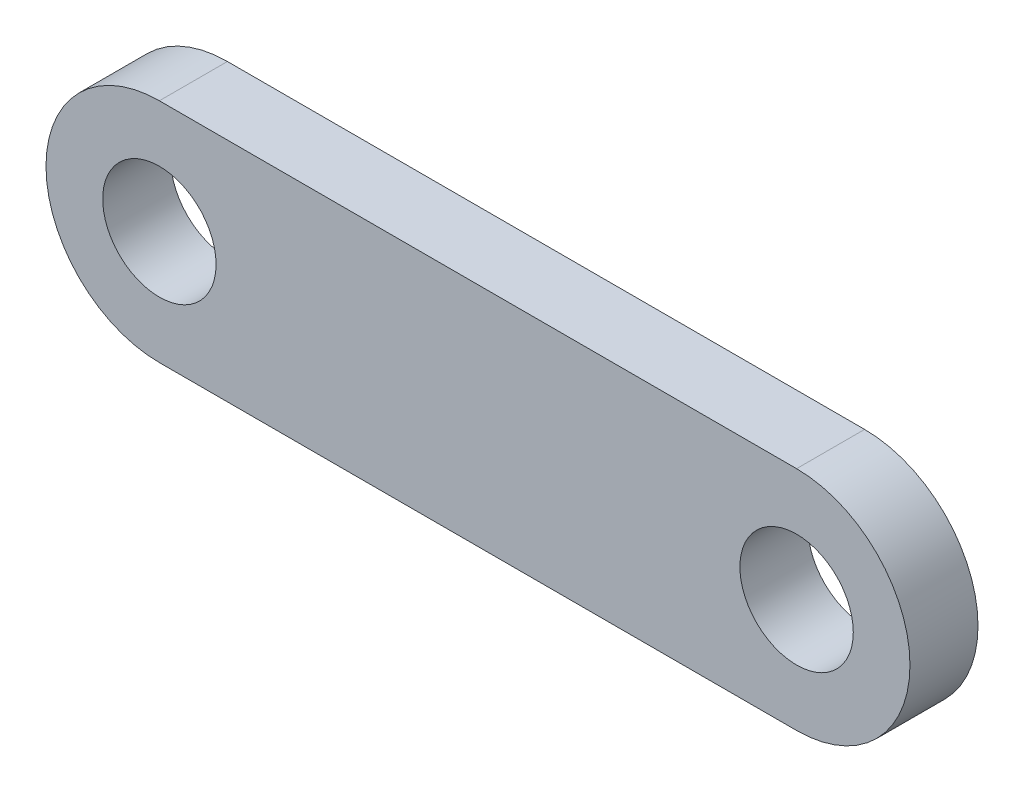
ISO-10303-21;
HEADER;
FILE_DESCRIPTION(('STEP AP214'),'2;1');
FILE_NAME('part.step','',(''),(''),'','','');
FILE_SCHEMA(('AUTOMOTIVE_DESIGN { 1 0 10303 214 1 1 1 1 }'));
ENDSEC;
DATA;
#1=APPLICATION_CONTEXT('core data for automotive mechanical design processes');
#2=APPLICATION_PROTOCOL_DEFINITION('international standard','automotive_design',2000,#1);
#3=PRODUCT_CONTEXT('',#1,'mechanical');
#4=PRODUCT('Part','Part','',(#3));
#5=PRODUCT_RELATED_PRODUCT_CATEGORY('part','',(#4));
#6=PRODUCT_DEFINITION_FORMATION('','',#4);
#7=PRODUCT_DEFINITION_CONTEXT('part definition',#1,'design');
#8=PRODUCT_DEFINITION('design','',#6,#7);
#9=PRODUCT_DEFINITION_SHAPE('','',#8);
#10=(LENGTH_UNIT() NAMED_UNIT(*) SI_UNIT(.MILLI.,.METRE.));
#11=(NAMED_UNIT(*) PLANE_ANGLE_UNIT() SI_UNIT($,.RADIAN.));
#12=(NAMED_UNIT(*) SI_UNIT($,.STERADIAN.) SOLID_ANGLE_UNIT());
#13=UNCERTAINTY_MEASURE_WITH_UNIT(LENGTH_MEASURE(1.E-05),#10,'distance_accuracy_value','');
#14=(GEOMETRIC_REPRESENTATION_CONTEXT(3) GLOBAL_UNCERTAINTY_ASSIGNED_CONTEXT((#13)) GLOBAL_UNIT_ASSIGNED_CONTEXT((#10,
#11,#12)) REPRESENTATION_CONTEXT('',''));
#15=CARTESIAN_POINT('',(0.,0.,0.));
#16=DIRECTION('',(0.,0.,1.));
#17=DIRECTION('',(1.,0.,0.));
#18=AXIS2_PLACEMENT_3D('',#15,#16,#17);
#19=CARTESIAN_POINT('',(-28.7828289980959,0.,6.));
#20=DIRECTION('',(0.,0.,1.));
#21=DIRECTION('',(1.,0.,0.));
#22=AXIS2_PLACEMENT_3D('',#19,#20,#21);
#23=PLANE('',#22);
#24=CARTESIAN_POINT('',(-28.7828289980959,0.,6.));
#25=DIRECTION('',(0.,0.,1.));
#26=DIRECTION('',(1.,0.,0.));
#27=AXIS2_PLACEMENT_3D('',#24,#25,#26);
#28=CIRCLE('',#27,5.);
#29=CARTESIAN_POINT('',(-23.7828289980959,0.,6.));
#30=VERTEX_POINT('',#29);
#31=EDGE_CURVE('E112',#30,#30,#28,.T.);
#32=ORIENTED_EDGE('',*,*,#31,.F.);
#33=EDGE_LOOP('',(#32));
#34=FACE_BOUND('',#33,.T.);
#35=CARTESIAN_POINT('',(-28.7828289980959,0.,6.));
#36=DIRECTION('',(0.,0.,1.));
#37=DIRECTION('',(1.,0.,0.));
#38=AXIS2_PLACEMENT_3D('',#35,#36,#37);
#39=CIRCLE('',#38,10.);
#40=CARTESIAN_POINT('',(-28.7828289980959,10.,6.));
#41=VERTEX_POINT('',#40);
#42=CARTESIAN_POINT('',(-28.7828289980959,-10.,6.));
#43=VERTEX_POINT('',#42);
#44=EDGE_CURVE('E92',#41,#43,#39,.T.);
#45=ORIENTED_EDGE('',*,*,#44,.T.);
#46=DIRECTION('',(1.,0.,0.));
#47=VECTOR('',#46,1.);
#48=CARTESIAN_POINT('',(-28.7828289980959,-10.,6.));
#49=LINE('',#48,#47);
#50=CARTESIAN_POINT('',(27.4171710019041,-10.,6.));
#51=VERTEX_POINT('',#50);
#52=EDGE_CURVE('E87',#43,#51,#49,.T.);
#53=ORIENTED_EDGE('',*,*,#52,.T.);
#54=CARTESIAN_POINT('',(27.4171710019041,0.,6.));
#55=DIRECTION('',(0.,0.,1.));
#56=DIRECTION('',(1.,0.,0.));
#57=AXIS2_PLACEMENT_3D('',#54,#55,#56);
#58=CIRCLE('',#57,10.);
#59=CARTESIAN_POINT('',(27.4171710019041,10.,6.));
#60=VERTEX_POINT('',#59);
#61=EDGE_CURVE('E90',#51,#60,#58,.T.);
#62=ORIENTED_EDGE('',*,*,#61,.T.);
#63=DIRECTION('',(-1.,0.,0.));
#64=VECTOR('',#63,1.);
#65=CARTESIAN_POINT('',(-28.7828289980959,10.,6.));
#66=LINE('',#65,#64);
#67=EDGE_CURVE('E57',#60,#41,#66,.T.);
#68=ORIENTED_EDGE('',*,*,#67,.T.);
#69=EDGE_LOOP('',(#45,#53,#62,#68));
#70=FACE_BOUND('',#69,.T.);
#71=CARTESIAN_POINT('',(27.4171710019041,0.,6.));
#72=DIRECTION('',(0.,0.,1.));
#73=DIRECTION('',(1.,0.,0.));
#74=AXIS2_PLACEMENT_3D('',#71,#72,#73);
#75=CIRCLE('',#74,5.);
#76=CARTESIAN_POINT('',(32.4171710019041,0.,6.));
#77=VERTEX_POINT('',#76);
#78=EDGE_CURVE('E134',#77,#77,#75,.T.);
#79=ORIENTED_EDGE('',*,*,#78,.F.);
#80=EDGE_LOOP('',(#79));
#81=FACE_BOUND('',#80,.T.);
#82=ADVANCED_FACE('F39',(#34,#70,#81),#23,.T.);
#83=CARTESIAN_POINT('',(-28.7828289980959,0.,0.));
#84=DIRECTION('',(0.,0.,1.));
#85=DIRECTION('',(1.,0.,0.));
#86=AXIS2_PLACEMENT_3D('',#83,#84,#85);
#87=PLANE('',#86);
#88=CARTESIAN_POINT('',(-28.7828289980959,0.,0.));
#89=DIRECTION('',(0.,0.,1.));
#90=DIRECTION('',(1.,0.,0.));
#91=AXIS2_PLACEMENT_3D('',#88,#89,#90);
#92=CIRCLE('',#91,10.);
#93=CARTESIAN_POINT('',(-28.7828289980959,10.,0.));
#94=VERTEX_POINT('',#93);
#95=CARTESIAN_POINT('',(-28.7828289980959,-10.,0.));
#96=VERTEX_POINT('',#95);
#97=EDGE_CURVE('E108',#94,#96,#92,.T.);
#98=ORIENTED_EDGE('',*,*,#97,.F.);
#99=DIRECTION('',(-1.,0.,0.));
#100=VECTOR('',#99,1.);
#101=CARTESIAN_POINT('',(-28.7828289980959,10.,0.));
#102=LINE('',#101,#100);
#103=CARTESIAN_POINT('',(27.4171710019041,10.,0.));
#104=VERTEX_POINT('',#103);
#105=EDGE_CURVE('E80',#104,#94,#102,.T.);
#106=ORIENTED_EDGE('',*,*,#105,.F.);
#107=CARTESIAN_POINT('',(27.4171710019041,0.,0.));
#108=DIRECTION('',(0.,0.,1.));
#109=DIRECTION('',(1.,0.,0.));
#110=AXIS2_PLACEMENT_3D('',#107,#108,#109);
#111=CIRCLE('',#110,10.);
#112=CARTESIAN_POINT('',(27.4171710019041,-10.,0.));
#113=VERTEX_POINT('',#112);
#114=EDGE_CURVE('E74',#113,#104,#111,.T.);
#115=ORIENTED_EDGE('',*,*,#114,.F.);
#116=DIRECTION('',(1.,0.,0.));
#117=VECTOR('',#116,1.);
#118=CARTESIAN_POINT('',(-28.7828289980959,-10.,0.));
#119=LINE('',#118,#117);
#120=EDGE_CURVE('E97',#96,#113,#119,.T.);
#121=ORIENTED_EDGE('',*,*,#120,.F.);
#122=EDGE_LOOP('',(#98,#106,#115,#121));
#123=FACE_BOUND('',#122,.T.);
#124=CARTESIAN_POINT('',(-28.7828289980959,0.,0.));
#125=DIRECTION('',(0.,0.,1.));
#126=DIRECTION('',(1.,0.,0.));
#127=AXIS2_PLACEMENT_3D('',#124,#125,#126);
#128=CIRCLE('',#127,5.);
#129=CARTESIAN_POINT('',(-23.7828289980959,0.,0.));
#130=VERTEX_POINT('',#129);
#131=EDGE_CURVE('E130',#130,#130,#128,.T.);
#132=ORIENTED_EDGE('',*,*,#131,.T.);
#133=EDGE_LOOP('',(#132));
#134=FACE_BOUND('',#133,.T.);
#135=CARTESIAN_POINT('',(27.4171710019041,0.,0.));
#136=DIRECTION('',(0.,0.,1.));
#137=DIRECTION('',(1.,0.,0.));
#138=AXIS2_PLACEMENT_3D('',#135,#136,#137);
#139=CIRCLE('',#138,5.);
#140=CARTESIAN_POINT('',(32.4171710019041,0.,0.));
#141=VERTEX_POINT('',#140);
#142=EDGE_CURVE('E138',#141,#141,#139,.T.);
#143=ORIENTED_EDGE('',*,*,#142,.T.);
#144=EDGE_LOOP('',(#143));
#145=FACE_BOUND('',#144,.T.);
#146=ADVANCED_FACE('F125',(#123,#134,#145),#87,.F.);
#147=CARTESIAN_POINT('',(-28.7828289980959,0.,6.));
#148=DIRECTION('',(0.,0.,-1.));
#149=DIRECTION('',(-1.,0.,0.));
#150=AXIS2_PLACEMENT_3D('',#147,#148,#149);
#151=CYLINDRICAL_SURFACE('',#150,10.);
#152=ORIENTED_EDGE('',*,*,#97,.T.);
#153=DIRECTION('',(0.,0.,-1.));
#154=VECTOR('',#153,1.);
#155=CARTESIAN_POINT('',(-28.7828289980959,-10.,6.));
#156=LINE('',#155,#154);
#157=EDGE_CURVE('E11',#43,#96,#156,.T.);
#158=ORIENTED_EDGE('',*,*,#157,.F.);
#159=ORIENTED_EDGE('',*,*,#44,.F.);
#160=DIRECTION('',(0.,0.,-1.));
#161=VECTOR('',#160,1.);
#162=CARTESIAN_POINT('',(-28.7828289980959,10.,6.));
#163=LINE('',#162,#161);
#164=EDGE_CURVE('E104',#41,#94,#163,.T.);
#165=ORIENTED_EDGE('',*,*,#164,.T.);
#166=EDGE_LOOP('',(#152,#158,#159,#165));
#167=FACE_BOUND('',#166,.T.);
#168=ADVANCED_FACE('F41',(#167),#151,.T.);
#169=CARTESIAN_POINT('',(-28.7828289980959,-10.,6.));
#170=DIRECTION('',(0.,1.,0.));
#171=DIRECTION('',(0.,0.,1.));
#172=AXIS2_PLACEMENT_3D('',#169,#170,#171);
#173=PLANE('',#172);
#174=ORIENTED_EDGE('',*,*,#120,.T.);
#175=DIRECTION('',(0.,0.,-1.));
#176=VECTOR('',#175,1.);
#177=CARTESIAN_POINT('',(27.4171710019041,-10.,6.));
#178=LINE('',#177,#176);
#179=EDGE_CURVE('E49',#51,#113,#178,.T.);
#180=ORIENTED_EDGE('',*,*,#179,.F.);
#181=ORIENTED_EDGE('',*,*,#52,.F.);
#182=ORIENTED_EDGE('',*,*,#157,.T.);
#183=EDGE_LOOP('',(#174,#180,#181,#182));
#184=FACE_BOUND('',#183,.T.);
#185=ADVANCED_FACE('F96',(#184),#173,.F.);
#186=CARTESIAN_POINT('',(27.4171710019041,0.,6.));
#187=DIRECTION('',(0.,0.,-1.));
#188=DIRECTION('',(-1.,0.,0.));
#189=AXIS2_PLACEMENT_3D('',#186,#187,#188);
#190=CYLINDRICAL_SURFACE('',#189,10.);
#191=ORIENTED_EDGE('',*,*,#114,.T.);
#192=DIRECTION('',(0.,0.,-1.));
#193=VECTOR('',#192,1.);
#194=CARTESIAN_POINT('',(27.4171710019041,10.,6.));
#195=LINE('',#194,#193);
#196=EDGE_CURVE('E99',#60,#104,#195,.T.);
#197=ORIENTED_EDGE('',*,*,#196,.F.);
#198=ORIENTED_EDGE('',*,*,#61,.F.);
#199=ORIENTED_EDGE('',*,*,#179,.T.);
#200=EDGE_LOOP('',(#191,#197,#198,#199));
#201=FACE_BOUND('',#200,.T.);
#202=ADVANCED_FACE('F100',(#201),#190,.T.);
#203=CARTESIAN_POINT('',(-28.7828289980959,10.,6.));
#204=DIRECTION('',(0.,-1.,0.));
#205=DIRECTION('',(0.,0.,-1.));
#206=AXIS2_PLACEMENT_3D('',#203,#204,#205);
#207=PLANE('',#206);
#208=ORIENTED_EDGE('',*,*,#105,.T.);
#209=ORIENTED_EDGE('',*,*,#164,.F.);
#210=ORIENTED_EDGE('',*,*,#67,.F.);
#211=ORIENTED_EDGE('',*,*,#196,.T.);
#212=EDGE_LOOP('',(#208,#209,#210,#211));
#213=FACE_BOUND('',#212,.T.);
#214=ADVANCED_FACE('F122',(#213),#207,.F.);
#215=CARTESIAN_POINT('',(-28.7828289980959,0.,6.));
#216=DIRECTION('',(0.,0.,-1.));
#217=DIRECTION('',(-1.,0.,0.));
#218=AXIS2_PLACEMENT_3D('',#215,#216,#217);
#219=CYLINDRICAL_SURFACE('',#218,5.);
#220=ORIENTED_EDGE('',*,*,#31,.T.);
#221=EDGE_LOOP('',(#220));
#222=FACE_BOUND('',#221,.T.);
#223=ORIENTED_EDGE('',*,*,#131,.F.);
#224=EDGE_LOOP('',(#223));
#225=FACE_BOUND('',#224,.T.);
#226=ADVANCED_FACE('F157',(#222,#225),#219,.F.);
#227=CARTESIAN_POINT('',(27.4171710019041,0.,6.));
#228=DIRECTION('',(0.,0.,-1.));
#229=DIRECTION('',(-1.,0.,0.));
#230=AXIS2_PLACEMENT_3D('',#227,#228,#229);
#231=CYLINDRICAL_SURFACE('',#230,5.);
#232=ORIENTED_EDGE('',*,*,#78,.T.);
#233=EDGE_LOOP('',(#232));
#234=FACE_BOUND('',#233,.T.);
#235=ORIENTED_EDGE('',*,*,#142,.F.);
#236=EDGE_LOOP('',(#235));
#237=FACE_BOUND('',#236,.T.);
#238=ADVANCED_FACE('F146',(#234,#237),#231,.F.);
#239=CLOSED_SHELL('',(#82,#146,#168,#185,#202,#214,#226,#238));
#240=MANIFOLD_SOLID_BREP('B2',#239);
#241=ADVANCED_BREP_SHAPE_REPRESENTATION('',(#18,#240),#14);
#242=SHAPE_DEFINITION_REPRESENTATION(#9,#241);
ENDSEC;
END-ISO-10303-21;
